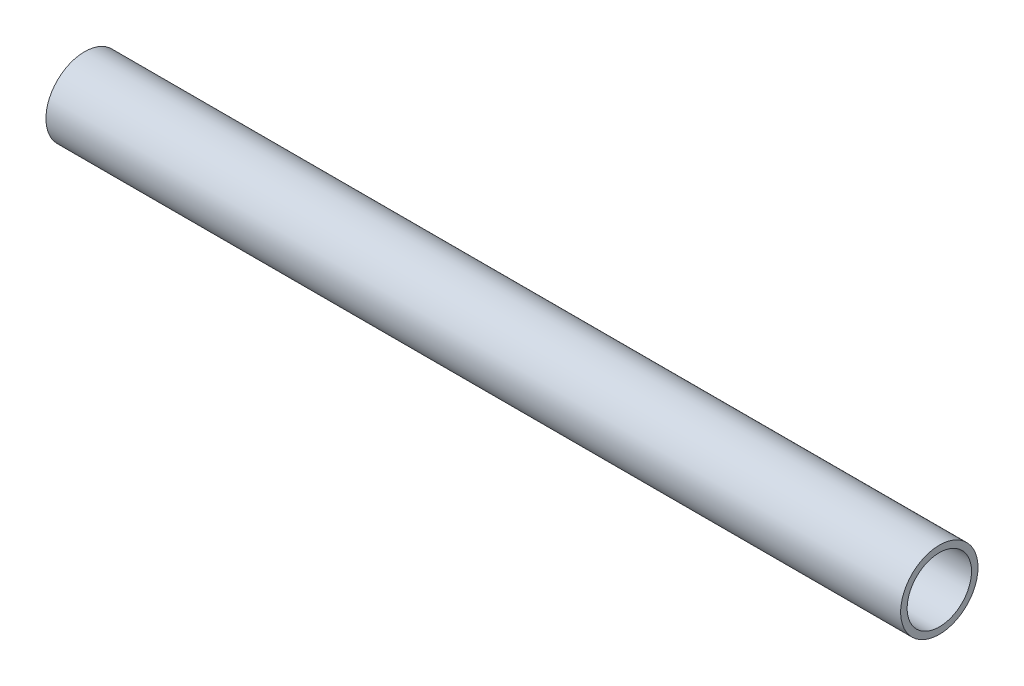
ISO-10303-21;
HEADER;
FILE_DESCRIPTION(('STEP AP214'),'2;1');
FILE_NAME('part.step','',(''),(''),'','','');
FILE_SCHEMA(('AUTOMOTIVE_DESIGN { 1 0 10303 214 1 1 1 1 }'));
ENDSEC;
DATA;
#1=APPLICATION_CONTEXT('core data for automotive mechanical design processes');
#2=APPLICATION_PROTOCOL_DEFINITION('international standard','automotive_design',2000,#1);
#3=PRODUCT_CONTEXT('',#1,'mechanical');
#4=PRODUCT('Part','Part','',(#3));
#5=PRODUCT_RELATED_PRODUCT_CATEGORY('part','',(#4));
#6=PRODUCT_DEFINITION_FORMATION('','',#4);
#7=PRODUCT_DEFINITION_CONTEXT('part definition',#1,'design');
#8=PRODUCT_DEFINITION('design','',#6,#7);
#9=PRODUCT_DEFINITION_SHAPE('','',#8);
#10=(LENGTH_UNIT() NAMED_UNIT(*) SI_UNIT(.MILLI.,.METRE.));
#11=(NAMED_UNIT(*) PLANE_ANGLE_UNIT() SI_UNIT($,.RADIAN.));
#12=(NAMED_UNIT(*) SI_UNIT($,.STERADIAN.) SOLID_ANGLE_UNIT());
#13=UNCERTAINTY_MEASURE_WITH_UNIT(LENGTH_MEASURE(1.E-05),#10,'distance_accuracy_value','');
#14=(GEOMETRIC_REPRESENTATION_CONTEXT(3) GLOBAL_UNCERTAINTY_ASSIGNED_CONTEXT((#13)) GLOBAL_UNIT_ASSIGNED_CONTEXT((#10,
#11,#12)) REPRESENTATION_CONTEXT('',''));
#15=CARTESIAN_POINT('',(0.,0.,0.));
#16=DIRECTION('',(0.,0.,1.));
#17=DIRECTION('',(1.,0.,0.));
#18=AXIS2_PLACEMENT_3D('',#15,#16,#17);
#19=CARTESIAN_POINT('',(33.8327416399906,1471.85967450442,0.));
#20=DIRECTION('',(-1.,0.,0.));
#21=DIRECTION('',(0.,0.,1.));
#22=AXIS2_PLACEMENT_3D('',#19,#20,#21);
#23=CYLINDRICAL_SURFACE('',#22,5.28319999999993);
#24=CARTESIAN_POINT('',(33.8327416399906,1471.85967450442,0.));
#25=DIRECTION('',(1.,0.,0.));
#26=DIRECTION('',(0.,0.,-1.));
#27=AXIS2_PLACEMENT_3D('',#24,#25,#26);
#28=CIRCLE('',#27,5.28319999999993);
#29=CARTESIAN_POINT('',(33.8327416399906,1471.85967450442,-5.28319999999993));
#30=VERTEX_POINT('',#29);
#31=EDGE_CURVE('E45',#30,#30,#28,.T.);
#32=ORIENTED_EDGE('',*,*,#31,.T.);
#33=EDGE_LOOP('',(#32));
#34=FACE_BOUND('',#33,.T.);
#35=CARTESIAN_POINT('',(-106.534019986548,1471.85967450442,0.));
#36=DIRECTION('',(1.,0.,0.));
#37=DIRECTION('',(0.,0.,-1.));
#38=AXIS2_PLACEMENT_3D('',#35,#36,#37);
#39=CIRCLE('',#38,5.28319999999993);
#40=CARTESIAN_POINT('',(-106.534019986548,1471.85967450442,-5.28319999999993));
#41=VERTEX_POINT('',#40);
#42=EDGE_CURVE('E51',#41,#41,#39,.T.);
#43=ORIENTED_EDGE('',*,*,#42,.F.);
#44=EDGE_LOOP('',(#43));
#45=FACE_BOUND('',#44,.T.);
#46=ADVANCED_FACE('F38',(#34,#45),#23,.F.);
#47=CARTESIAN_POINT('',(33.8327416399906,1471.85967450442,0.));
#48=DIRECTION('',(-1.,0.,0.));
#49=DIRECTION('',(0.,0.,1.));
#50=AXIS2_PLACEMENT_3D('',#47,#48,#49);
#51=CYLINDRICAL_SURFACE('',#50,6.34999999999994);
#52=CARTESIAN_POINT('',(33.8327416399906,1471.85967450442,0.));
#53=DIRECTION('',(1.,0.,0.));
#54=DIRECTION('',(0.,0.,-1.));
#55=AXIS2_PLACEMENT_3D('',#52,#53,#54);
#56=CIRCLE('',#55,6.34999999999994);
#57=CARTESIAN_POINT('',(33.8327416399906,1471.85967450442,-6.34999999999994));
#58=VERTEX_POINT('',#57);
#59=EDGE_CURVE('E11',#58,#58,#56,.T.);
#60=ORIENTED_EDGE('',*,*,#59,.F.);
#61=EDGE_LOOP('',(#60));
#62=FACE_BOUND('',#61,.T.);
#63=CARTESIAN_POINT('',(-106.534019986548,1471.85967450442,0.));
#64=DIRECTION('',(1.,0.,0.));
#65=DIRECTION('',(0.,0.,-1.));
#66=AXIS2_PLACEMENT_3D('',#63,#64,#65);
#67=CIRCLE('',#66,6.34999999999994);
#68=CARTESIAN_POINT('',(-106.534019986548,1471.85967450442,-6.34999999999994));
#69=VERTEX_POINT('',#68);
#70=EDGE_CURVE('E41',#69,#69,#67,.T.);
#71=ORIENTED_EDGE('',*,*,#70,.T.);
#72=EDGE_LOOP('',(#71));
#73=FACE_BOUND('',#72,.T.);
#74=ADVANCED_FACE('F58',(#62,#73),#51,.T.);
#75=CARTESIAN_POINT('',(33.8327416399906,1471.85967450442,0.));
#76=DIRECTION('',(1.,0.,0.));
#77=DIRECTION('',(0.,0.,-1.));
#78=AXIS2_PLACEMENT_3D('',#75,#76,#77);
#79=PLANE('',#78);
#80=ORIENTED_EDGE('',*,*,#31,.F.);
#81=EDGE_LOOP('',(#80));
#82=FACE_BOUND('',#81,.T.);
#83=ORIENTED_EDGE('',*,*,#59,.T.);
#84=EDGE_LOOP('',(#83));
#85=FACE_BOUND('',#84,.T.);
#86=ADVANCED_FACE('F62',(#82,#85),#79,.T.);
#87=CARTESIAN_POINT('',(-106.534019986548,1471.85967450442,0.));
#88=DIRECTION('',(1.,0.,0.));
#89=DIRECTION('',(0.,0.,-1.));
#90=AXIS2_PLACEMENT_3D('',#87,#88,#89);
#91=PLANE('',#90);
#92=ORIENTED_EDGE('',*,*,#42,.T.);
#93=EDGE_LOOP('',(#92));
#94=FACE_BOUND('',#93,.T.);
#95=ORIENTED_EDGE('',*,*,#70,.F.);
#96=EDGE_LOOP('',(#95));
#97=FACE_BOUND('',#96,.T.);
#98=ADVANCED_FACE('F60',(#94,#97),#91,.F.);
#99=CLOSED_SHELL('',(#46,#74,#86,#98));
#100=MANIFOLD_SOLID_BREP('B2',#99);
#101=ADVANCED_BREP_SHAPE_REPRESENTATION('',(#18,#100),#14);
#102=SHAPE_DEFINITION_REPRESENTATION(#9,#101);
ENDSEC;
END-ISO-10303-21;
